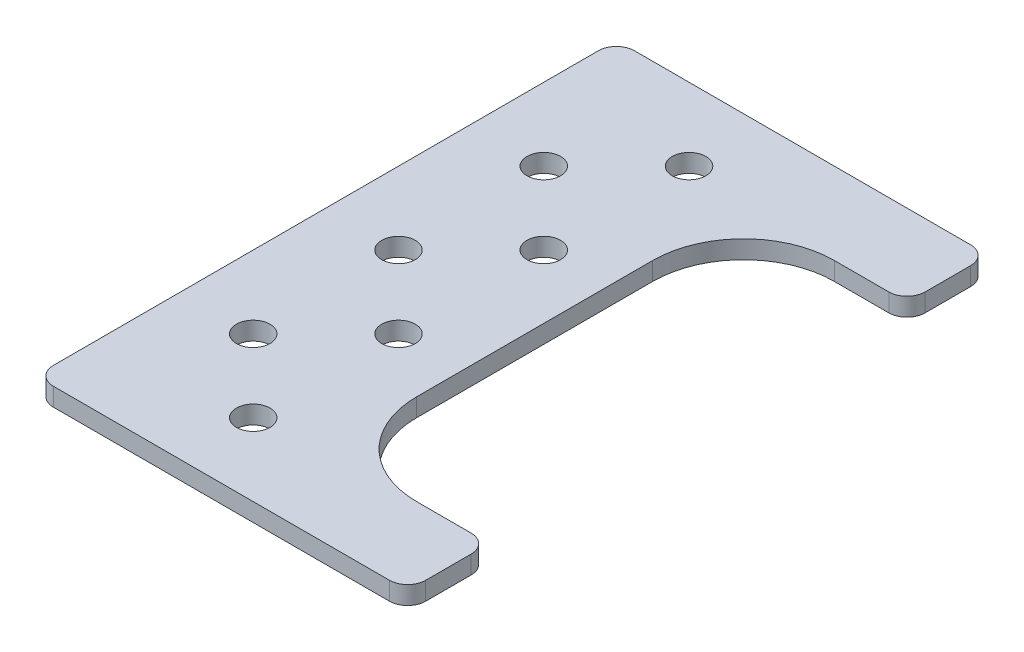
ISO-10303-21;
HEADER;
FILE_DESCRIPTION(('STEP AP214'),'2;1');
FILE_NAME('part.step','',(''),(''),'','','');
FILE_SCHEMA(('AUTOMOTIVE_DESIGN { 1 0 10303 214 1 1 1 1 }'));
ENDSEC;
DATA;
#1=APPLICATION_CONTEXT('core data for automotive mechanical design processes');
#2=APPLICATION_PROTOCOL_DEFINITION('international standard','automotive_design',2000,#1);
#3=PRODUCT_CONTEXT('',#1,'mechanical');
#4=PRODUCT('Part','Part','',(#3));
#5=PRODUCT_RELATED_PRODUCT_CATEGORY('part','',(#4));
#6=PRODUCT_DEFINITION_FORMATION('','',#4);
#7=PRODUCT_DEFINITION_CONTEXT('part definition',#1,'design');
#8=PRODUCT_DEFINITION('design','',#6,#7);
#9=PRODUCT_DEFINITION_SHAPE('','',#8);
#10=(LENGTH_UNIT() NAMED_UNIT(*) SI_UNIT(.MILLI.,.METRE.));
#11=(NAMED_UNIT(*) PLANE_ANGLE_UNIT() SI_UNIT($,.RADIAN.));
#12=(NAMED_UNIT(*) SI_UNIT($,.STERADIAN.) SOLID_ANGLE_UNIT());
#13=UNCERTAINTY_MEASURE_WITH_UNIT(LENGTH_MEASURE(1.E-05),#10,'distance_accuracy_value','');
#14=(GEOMETRIC_REPRESENTATION_CONTEXT(3) GLOBAL_UNCERTAINTY_ASSIGNED_CONTEXT((#13)) GLOBAL_UNIT_ASSIGNED_CONTEXT((#10,
#11,#12)) REPRESENTATION_CONTEXT('',''));
#15=CARTESIAN_POINT('',(0.,0.,0.));
#16=DIRECTION('',(0.,0.,1.));
#17=DIRECTION('',(1.,0.,0.));
#18=AXIS2_PLACEMENT_3D('',#15,#16,#17);
#19=CARTESIAN_POINT('',(0.,0.,0.));
#20=DIRECTION('',(0.,1.,0.));
#21=DIRECTION('',(0.,0.,1.));
#22=AXIS2_PLACEMENT_3D('',#19,#20,#21);
#23=PLANE('',#22);
#24=CARTESIAN_POINT('',(16.,0.,-8.));
#25=DIRECTION('',(0.,-1.,0.));
#26=DIRECTION('',(0.,0.,-1.));
#27=AXIS2_PLACEMENT_3D('',#24,#25,#26);
#28=CIRCLE('',#27,1.85);
#29=CARTESIAN_POINT('',(16.,0.,-9.85));
#30=VERTEX_POINT('',#29);
#31=EDGE_CURVE('E225',#30,#30,#28,.F.);
#32=ORIENTED_EDGE('',*,*,#31,.T.);
#33=EDGE_LOOP('',(#32));
#34=FACE_BOUND('',#33,.T.);
#35=CARTESIAN_POINT('',(16.,0.,-40.));
#36=DIRECTION('',(0.,-1.,0.));
#37=DIRECTION('',(0.,0.,-1.));
#38=AXIS2_PLACEMENT_3D('',#35,#36,#37);
#39=CIRCLE('',#38,1.85);
#40=CARTESIAN_POINT('',(16.,0.,-41.85));
#41=VERTEX_POINT('',#40);
#42=EDGE_CURVE('E228',#41,#41,#39,.F.);
#43=ORIENTED_EDGE('',*,*,#42,.T.);
#44=EDGE_LOOP('',(#43));
#45=FACE_BOUND('',#44,.T.);
#46=CARTESIAN_POINT('',(8.,0.,-16.));
#47=DIRECTION('',(0.,-1.,0.));
#48=DIRECTION('',(0.,0.,-1.));
#49=AXIS2_PLACEMENT_3D('',#46,#47,#48);
#50=CIRCLE('',#49,1.85);
#51=CARTESIAN_POINT('',(8.,0.,-17.85));
#52=VERTEX_POINT('',#51);
#53=EDGE_CURVE('E231',#52,#52,#50,.F.);
#54=ORIENTED_EDGE('',*,*,#53,.T.);
#55=EDGE_LOOP('',(#54));
#56=FACE_BOUND('',#55,.T.);
#57=CARTESIAN_POINT('',(8.,0.,-32.));
#58=DIRECTION('',(0.,-1.,0.));
#59=DIRECTION('',(0.,0.,-1.));
#60=AXIS2_PLACEMENT_3D('',#57,#58,#59);
#61=CIRCLE('',#60,1.85);
#62=CARTESIAN_POINT('',(8.,0.,-33.85));
#63=VERTEX_POINT('',#62);
#64=EDGE_CURVE('E234',#63,#63,#61,.F.);
#65=ORIENTED_EDGE('',*,*,#64,.T.);
#66=EDGE_LOOP('',(#65));
#67=FACE_BOUND('',#66,.T.);
#68=CARTESIAN_POINT('',(8.,0.,-48.));
#69=DIRECTION('',(0.,-1.,0.));
#70=DIRECTION('',(0.,0.,-1.));
#71=AXIS2_PLACEMENT_3D('',#68,#69,#70);
#72=CIRCLE('',#71,1.85);
#73=CARTESIAN_POINT('',(8.,0.,-49.85));
#74=VERTEX_POINT('',#73);
#75=EDGE_CURVE('E237',#74,#74,#72,.F.);
#76=ORIENTED_EDGE('',*,*,#75,.T.);
#77=EDGE_LOOP('',(#76));
#78=FACE_BOUND('',#77,.T.);
#79=CARTESIAN_POINT('',(16.,0.,-56.));
#80=DIRECTION('',(0.,-1.,0.));
#81=DIRECTION('',(0.,0.,-1.));
#82=AXIS2_PLACEMENT_3D('',#79,#80,#81);
#83=CIRCLE('',#82,1.85);
#84=CARTESIAN_POINT('',(16.,0.,-57.85));
#85=VERTEX_POINT('',#84);
#86=EDGE_CURVE('E240',#85,#85,#83,.F.);
#87=ORIENTED_EDGE('',*,*,#86,.T.);
#88=EDGE_LOOP('',(#87));
#89=FACE_BOUND('',#88,.T.);
#90=CARTESIAN_POINT('',(16.,0.,-24.));
#91=DIRECTION('',(0.,-1.,0.));
#92=DIRECTION('',(0.,0.,-1.));
#93=AXIS2_PLACEMENT_3D('',#90,#91,#92);
#94=CIRCLE('',#93,1.85);
#95=CARTESIAN_POINT('',(16.,0.,-25.85));
#96=VERTEX_POINT('',#95);
#97=EDGE_CURVE('E141',#96,#96,#94,.F.);
#98=ORIENTED_EDGE('',*,*,#97,.T.);
#99=EDGE_LOOP('',(#98));
#100=FACE_BOUND('',#99,.T.);
#101=DIRECTION('',(-1.,0.,0.));
#102=VECTOR('',#101,1.);
#103=CARTESIAN_POINT('',(0.,0.,0.));
#104=LINE('',#103,#102);
#105=CARTESIAN_POINT('',(39.,0.,0.));
#106=VERTEX_POINT('',#105);
#107=CARTESIAN_POINT('',(2.,0.,0.));
#108=VERTEX_POINT('',#107);
#109=EDGE_CURVE('E129',#106,#108,#104,.T.);
#110=ORIENTED_EDGE('',*,*,#109,.T.);
#111=CARTESIAN_POINT('',(2.,0.,-2.));
#112=DIRECTION('',(0.,-1.,0.));
#113=DIRECTION('',(0.,0.,-1.));
#114=AXIS2_PLACEMENT_3D('',#111,#112,#113);
#115=CIRCLE('',#114,2.);
#116=CARTESIAN_POINT('',(0.,0.,-2.));
#117=VERTEX_POINT('',#116);
#118=EDGE_CURVE('E144',#117,#108,#115,.F.);
#119=ORIENTED_EDGE('',*,*,#118,.F.);
#120=DIRECTION('',(0.,0.,-1.));
#121=VECTOR('',#120,1.);
#122=CARTESIAN_POINT('',(0.,0.,-64.));
#123=LINE('',#122,#121);
#124=CARTESIAN_POINT('',(0.,0.,-62.));
#125=VERTEX_POINT('',#124);
#126=EDGE_CURVE('E153',#117,#125,#123,.T.);
#127=ORIENTED_EDGE('',*,*,#126,.T.);
#128=CARTESIAN_POINT('',(1.99999999999999,0.,-62.));
#129=DIRECTION('',(0.,-1.,0.));
#130=DIRECTION('',(0.,0.,-1.));
#131=AXIS2_PLACEMENT_3D('',#128,#129,#130);
#132=CIRCLE('',#131,2.);
#133=CARTESIAN_POINT('',(1.99999999999999,0.,-64.));
#134=VERTEX_POINT('',#133);
#135=EDGE_CURVE('E156',#134,#125,#132,.F.);
#136=ORIENTED_EDGE('',*,*,#135,.F.);
#137=DIRECTION('',(1.,0.,0.));
#138=VECTOR('',#137,1.);
#139=CARTESIAN_POINT('',(41.,0.,-64.));
#140=LINE('',#139,#138);
#141=CARTESIAN_POINT('',(39.,0.,-64.));
#142=VERTEX_POINT('',#141);
#143=EDGE_CURVE('E157',#134,#142,#140,.T.);
#144=ORIENTED_EDGE('',*,*,#143,.T.);
#145=CARTESIAN_POINT('',(39.,0.,-62.));
#146=DIRECTION('',(0.,-1.,0.));
#147=DIRECTION('',(0.,0.,-1.));
#148=AXIS2_PLACEMENT_3D('',#145,#146,#147);
#149=CIRCLE('',#148,2.);
#150=CARTESIAN_POINT('',(41.,0.,-62.));
#151=VERTEX_POINT('',#150);
#152=EDGE_CURVE('E160',#151,#142,#149,.F.);
#153=ORIENTED_EDGE('',*,*,#152,.F.);
#154=DIRECTION('',(0.,0.,1.));
#155=VECTOR('',#154,1.);
#156=CARTESIAN_POINT('',(41.,0.,-64.));
#157=LINE('',#156,#155);
#158=CARTESIAN_POINT('',(41.,0.,-57.));
#159=VERTEX_POINT('',#158);
#160=EDGE_CURVE('E161',#151,#159,#157,.T.);
#161=ORIENTED_EDGE('',*,*,#160,.T.);
#162=CARTESIAN_POINT('',(39.,0.,-57.));
#163=DIRECTION('',(0.,-1.,0.));
#164=DIRECTION('',(0.,0.,-1.));
#165=AXIS2_PLACEMENT_3D('',#162,#163,#164);
#166=CIRCLE('',#165,2.);
#167=CARTESIAN_POINT('',(39.,0.,-55.));
#168=VERTEX_POINT('',#167);
#169=EDGE_CURVE('E164',#168,#159,#166,.F.);
#170=ORIENTED_EDGE('',*,*,#169,.F.);
#171=DIRECTION('',(-1.,0.,0.));
#172=VECTOR('',#171,1.);
#173=CARTESIAN_POINT('',(23.,0.,-55.));
#174=LINE('',#173,#172);
#175=CARTESIAN_POINT('',(33.,0.,-55.));
#176=VERTEX_POINT('',#175);
#177=EDGE_CURVE('E165',#168,#176,#174,.T.);
#178=ORIENTED_EDGE('',*,*,#177,.T.);
#179=CARTESIAN_POINT('',(33.,0.,-45.));
#180=DIRECTION('',(0.,1.,0.));
#181=DIRECTION('',(0.,0.,1.));
#182=AXIS2_PLACEMENT_3D('',#179,#180,#181);
#183=CIRCLE('',#182,10.);
#184=CARTESIAN_POINT('',(23.,0.,-45.));
#185=VERTEX_POINT('',#184);
#186=EDGE_CURVE('E254',#176,#185,#183,.T.);
#187=ORIENTED_EDGE('',*,*,#186,.T.);
#188=DIRECTION('',(0.,0.,1.));
#189=VECTOR('',#188,1.);
#190=CARTESIAN_POINT('',(23.,0.,-9.));
#191=LINE('',#190,#189);
#192=CARTESIAN_POINT('',(23.,0.,-19.));
#193=VERTEX_POINT('',#192);
#194=EDGE_CURVE('E169',#185,#193,#191,.T.);
#195=ORIENTED_EDGE('',*,*,#194,.T.);
#196=CARTESIAN_POINT('',(33.,0.,-19.));
#197=DIRECTION('',(0.,1.,0.));
#198=DIRECTION('',(0.,0.,1.));
#199=AXIS2_PLACEMENT_3D('',#196,#197,#198);
#200=CIRCLE('',#199,10.);
#201=CARTESIAN_POINT('',(33.,0.,-9.));
#202=VERTEX_POINT('',#201);
#203=EDGE_CURVE('E256',#193,#202,#200,.T.);
#204=ORIENTED_EDGE('',*,*,#203,.T.);
#205=DIRECTION('',(1.,0.,0.));
#206=VECTOR('',#205,1.);
#207=CARTESIAN_POINT('',(41.,0.,-9.));
#208=LINE('',#207,#206);
#209=CARTESIAN_POINT('',(39.,0.,-9.));
#210=VERTEX_POINT('',#209);
#211=EDGE_CURVE('E173',#202,#210,#208,.T.);
#212=ORIENTED_EDGE('',*,*,#211,.T.);
#213=CARTESIAN_POINT('',(39.,0.,-6.99999999999998));
#214=DIRECTION('',(0.,-1.,0.));
#215=DIRECTION('',(0.,0.,-1.));
#216=AXIS2_PLACEMENT_3D('',#213,#214,#215);
#217=CIRCLE('',#216,2.);
#218=CARTESIAN_POINT('',(41.,0.,-6.99999999999998));
#219=VERTEX_POINT('',#218);
#220=EDGE_CURVE('E176',#219,#210,#217,.F.);
#221=ORIENTED_EDGE('',*,*,#220,.F.);
#222=DIRECTION('',(0.,0.,1.));
#223=VECTOR('',#222,1.);
#224=CARTESIAN_POINT('',(41.,0.,-9.));
#225=LINE('',#224,#223);
#226=CARTESIAN_POINT('',(41.,0.,-2.00000000000001));
#227=VERTEX_POINT('',#226);
#228=EDGE_CURVE('E131',#219,#227,#225,.T.);
#229=ORIENTED_EDGE('',*,*,#228,.T.);
#230=CARTESIAN_POINT('',(39.,0.,-2.));
#231=DIRECTION('',(0.,-1.,0.));
#232=DIRECTION('',(0.,0.,-1.));
#233=AXIS2_PLACEMENT_3D('',#230,#231,#232);
#234=CIRCLE('',#233,2.);
#235=EDGE_CURVE('E18',#106,#227,#234,.F.);
#236=ORIENTED_EDGE('',*,*,#235,.F.);
#237=EDGE_LOOP('',(#110,#119,#127,#136,#144,#153,#161,#170,#178,#187,#195,#204,#212,#221,#229,#236));
#238=FACE_BOUND('',#237,.T.);
#239=ADVANCED_FACE('F15',(#34,#45,#56,#67,#78,#89,#100,#238),#23,.F.);
#240=CARTESIAN_POINT('',(39.,2.,-2.));
#241=DIRECTION('',(0.,-1.,0.));
#242=DIRECTION('',(0.,0.,-1.));
#243=AXIS2_PLACEMENT_3D('',#240,#241,#242);
#244=CYLINDRICAL_SURFACE('',#243,2.);
#245=DIRECTION('',(0.,1.,0.));
#246=VECTOR('',#245,1.);
#247=CARTESIAN_POINT('',(41.,2.,-2.00000000000002));
#248=LINE('',#247,#246);
#249=CARTESIAN_POINT('',(41.,2.,-2.00000000000001));
#250=VERTEX_POINT('',#249);
#251=EDGE_CURVE('E151',#227,#250,#248,.T.);
#252=ORIENTED_EDGE('',*,*,#251,.T.);
#253=CARTESIAN_POINT('',(39.,2.,-2.));
#254=DIRECTION('',(0.,-1.,0.));
#255=DIRECTION('',(0.,0.,-1.));
#256=AXIS2_PLACEMENT_3D('',#253,#254,#255);
#257=CIRCLE('',#256,2.);
#258=CARTESIAN_POINT('',(39.,2.,0.));
#259=VERTEX_POINT('',#258);
#260=EDGE_CURVE('E138',#259,#250,#257,.F.);
#261=ORIENTED_EDGE('',*,*,#260,.F.);
#262=DIRECTION('',(0.,1.,0.));
#263=VECTOR('',#262,1.);
#264=CARTESIAN_POINT('',(39.,2.,0.));
#265=LINE('',#264,#263);
#266=EDGE_CURVE('E135',#259,#106,#265,.F.);
#267=ORIENTED_EDGE('',*,*,#266,.T.);
#268=ORIENTED_EDGE('',*,*,#235,.T.);
#269=EDGE_LOOP('',(#252,#261,#267,#268));
#270=FACE_BOUND('',#269,.T.);
#271=ADVANCED_FACE('F136',(#270),#244,.T.);
#272=CARTESIAN_POINT('',(41.,2.,-9.));
#273=DIRECTION('',(-1.,0.,0.));
#274=DIRECTION('',(0.,0.,1.));
#275=AXIS2_PLACEMENT_3D('',#272,#273,#274);
#276=PLANE('',#275);
#277=ORIENTED_EDGE('',*,*,#228,.F.);
#278=DIRECTION('',(0.,-1.,0.));
#279=VECTOR('',#278,1.);
#280=CARTESIAN_POINT('',(41.,2.,-6.99999999999998));
#281=LINE('',#280,#279);
#282=CARTESIAN_POINT('',(41.,2.,-6.99999999999998));
#283=VERTEX_POINT('',#282);
#284=EDGE_CURVE('E258',#283,#219,#281,.T.);
#285=ORIENTED_EDGE('',*,*,#284,.F.);
#286=DIRECTION('',(0.,0.,1.));
#287=VECTOR('',#286,1.);
#288=CARTESIAN_POINT('',(41.,2.,0.));
#289=LINE('',#288,#287);
#290=EDGE_CURVE('E223',#250,#283,#289,.F.);
#291=ORIENTED_EDGE('',*,*,#290,.F.);
#292=ORIENTED_EDGE('',*,*,#251,.F.);
#293=EDGE_LOOP('',(#277,#285,#291,#292));
#294=FACE_BOUND('',#293,.T.);
#295=ADVANCED_FACE('F347',(#294),#276,.F.);
#296=CARTESIAN_POINT('',(39.,2.,-6.99999999999998));
#297=DIRECTION('',(0.,-1.,0.));
#298=DIRECTION('',(0.,0.,-1.));
#299=AXIS2_PLACEMENT_3D('',#296,#297,#298);
#300=CYLINDRICAL_SURFACE('',#299,2.);
#301=DIRECTION('',(0.,1.,0.));
#302=VECTOR('',#301,1.);
#303=CARTESIAN_POINT('',(39.,2.,-9.));
#304=LINE('',#303,#302);
#305=CARTESIAN_POINT('',(39.,2.,-9.));
#306=VERTEX_POINT('',#305);
#307=EDGE_CURVE('E175',#210,#306,#304,.T.);
#308=ORIENTED_EDGE('',*,*,#307,.T.);
#309=CARTESIAN_POINT('',(39.,2.,-6.99999999999998));
#310=DIRECTION('',(0.,-1.,0.));
#311=DIRECTION('',(0.,0.,-1.));
#312=AXIS2_PLACEMENT_3D('',#309,#310,#311);
#313=CIRCLE('',#312,2.);
#314=EDGE_CURVE('E220',#283,#306,#313,.F.);
#315=ORIENTED_EDGE('',*,*,#314,.F.);
#316=ORIENTED_EDGE('',*,*,#284,.T.);
#317=ORIENTED_EDGE('',*,*,#220,.T.);
#318=EDGE_LOOP('',(#308,#315,#316,#317));
#319=FACE_BOUND('',#318,.T.);
#320=ADVANCED_FACE('F344',(#319),#300,.T.);
#321=CARTESIAN_POINT('',(41.,2.,-9.));
#322=DIRECTION('',(0.,0.,1.));
#323=DIRECTION('',(1.,0.,0.));
#324=AXIS2_PLACEMENT_3D('',#321,#322,#323);
#325=PLANE('',#324);
#326=ORIENTED_EDGE('',*,*,#211,.F.);
#327=DIRECTION('',(0.,1.,0.));
#328=VECTOR('',#327,1.);
#329=CARTESIAN_POINT('',(33.,2.,-9.));
#330=LINE('',#329,#328);
#331=CARTESIAN_POINT('',(33.,2.,-9.));
#332=VERTEX_POINT('',#331);
#333=EDGE_CURVE('E172',#202,#332,#330,.T.);
#334=ORIENTED_EDGE('',*,*,#333,.T.);
#335=DIRECTION('',(1.,0.,0.));
#336=VECTOR('',#335,1.);
#337=CARTESIAN_POINT('',(0.,2.,-9.));
#338=LINE('',#337,#336);
#339=EDGE_CURVE('E219',#306,#332,#338,.F.);
#340=ORIENTED_EDGE('',*,*,#339,.F.);
#341=ORIENTED_EDGE('',*,*,#307,.F.);
#342=EDGE_LOOP('',(#326,#334,#340,#341));
#343=FACE_BOUND('',#342,.T.);
#344=ADVANCED_FACE('F343',(#343),#325,.F.);
#345=CARTESIAN_POINT('',(33.,2.,-19.));
#346=DIRECTION('',(0.,1.,0.));
#347=DIRECTION('',(0.,0.,1.));
#348=AXIS2_PLACEMENT_3D('',#345,#346,#347);
#349=CYLINDRICAL_SURFACE('',#348,10.);
#350=ORIENTED_EDGE('',*,*,#203,.F.);
#351=DIRECTION('',(0.,1.,0.));
#352=VECTOR('',#351,1.);
#353=CARTESIAN_POINT('',(23.,2.,-19.));
#354=LINE('',#353,#352);
#355=CARTESIAN_POINT('',(23.,2.,-19.));
#356=VERTEX_POINT('',#355);
#357=EDGE_CURVE('E171',#193,#356,#354,.T.);
#358=ORIENTED_EDGE('',*,*,#357,.T.);
#359=CARTESIAN_POINT('',(33.,2.,-19.));
#360=DIRECTION('',(0.,1.,0.));
#361=DIRECTION('',(0.,0.,1.));
#362=AXIS2_PLACEMENT_3D('',#359,#360,#361);
#363=CIRCLE('',#362,10.);
#364=EDGE_CURVE('E216',#332,#356,#363,.F.);
#365=ORIENTED_EDGE('',*,*,#364,.F.);
#366=ORIENTED_EDGE('',*,*,#333,.F.);
#367=EDGE_LOOP('',(#350,#358,#365,#366));
#368=FACE_BOUND('',#367,.T.);
#369=ADVANCED_FACE('F339',(#368),#349,.F.);
#370=CARTESIAN_POINT('',(23.,2.,-9.));
#371=DIRECTION('',(-1.,0.,0.));
#372=DIRECTION('',(0.,0.,1.));
#373=AXIS2_PLACEMENT_3D('',#370,#371,#372);
#374=PLANE('',#373);
#375=ORIENTED_EDGE('',*,*,#194,.F.);
#376=DIRECTION('',(0.,1.,0.));
#377=VECTOR('',#376,1.);
#378=CARTESIAN_POINT('',(23.,2.,-45.));
#379=LINE('',#378,#377);
#380=CARTESIAN_POINT('',(23.,2.,-45.));
#381=VERTEX_POINT('',#380);
#382=EDGE_CURVE('E168',#185,#381,#379,.T.);
#383=ORIENTED_EDGE('',*,*,#382,.T.);
#384=DIRECTION('',(0.,0.,1.));
#385=VECTOR('',#384,1.);
#386=CARTESIAN_POINT('',(23.,2.,0.));
#387=LINE('',#386,#385);
#388=EDGE_CURVE('E215',#356,#381,#387,.F.);
#389=ORIENTED_EDGE('',*,*,#388,.F.);
#390=ORIENTED_EDGE('',*,*,#357,.F.);
#391=EDGE_LOOP('',(#375,#383,#389,#390));
#392=FACE_BOUND('',#391,.T.);
#393=ADVANCED_FACE('F333',(#392),#374,.F.);
#394=CARTESIAN_POINT('',(33.,2.,-45.));
#395=DIRECTION('',(0.,1.,0.));
#396=DIRECTION('',(0.,0.,1.));
#397=AXIS2_PLACEMENT_3D('',#394,#395,#396);
#398=CYLINDRICAL_SURFACE('',#397,10.);
#399=ORIENTED_EDGE('',*,*,#186,.F.);
#400=DIRECTION('',(0.,1.,0.));
#401=VECTOR('',#400,1.);
#402=CARTESIAN_POINT('',(33.,2.,-55.));
#403=LINE('',#402,#401);
#404=CARTESIAN_POINT('',(33.,2.,-55.));
#405=VERTEX_POINT('',#404);
#406=EDGE_CURVE('E167',#176,#405,#403,.T.);
#407=ORIENTED_EDGE('',*,*,#406,.T.);
#408=CARTESIAN_POINT('',(33.,2.,-45.));
#409=DIRECTION('',(0.,1.,0.));
#410=DIRECTION('',(0.,0.,1.));
#411=AXIS2_PLACEMENT_3D('',#408,#409,#410);
#412=CIRCLE('',#411,10.);
#413=EDGE_CURVE('E212',#381,#405,#412,.F.);
#414=ORIENTED_EDGE('',*,*,#413,.F.);
#415=ORIENTED_EDGE('',*,*,#382,.F.);
#416=EDGE_LOOP('',(#399,#407,#414,#415));
#417=FACE_BOUND('',#416,.T.);
#418=ADVANCED_FACE('F329',(#417),#398,.F.);
#419=CARTESIAN_POINT('',(23.,2.,-55.));
#420=DIRECTION('',(0.,0.,-1.));
#421=DIRECTION('',(-1.,0.,0.));
#422=AXIS2_PLACEMENT_3D('',#419,#420,#421);
#423=PLANE('',#422);
#424=DIRECTION('',(1.,0.,0.));
#425=VECTOR('',#424,1.);
#426=CARTESIAN_POINT('',(0.,2.,-55.));
#427=LINE('',#426,#425);
#428=CARTESIAN_POINT('',(39.,2.,-55.));
#429=VERTEX_POINT('',#428);
#430=EDGE_CURVE('E211',#405,#429,#427,.T.);
#431=ORIENTED_EDGE('',*,*,#430,.F.);
#432=ORIENTED_EDGE('',*,*,#406,.F.);
#433=ORIENTED_EDGE('',*,*,#177,.F.);
#434=DIRECTION('',(0.,-1.,0.));
#435=VECTOR('',#434,1.);
#436=CARTESIAN_POINT('',(39.,2.,-55.));
#437=LINE('',#436,#435);
#438=EDGE_CURVE('E253',#429,#168,#437,.T.);
#439=ORIENTED_EDGE('',*,*,#438,.F.);
#440=EDGE_LOOP('',(#431,#432,#433,#439));
#441=FACE_BOUND('',#440,.T.);
#442=ADVANCED_FACE('F323',(#441),#423,.F.);
#443=CARTESIAN_POINT('',(39.,2.,-57.));
#444=DIRECTION('',(0.,-1.,0.));
#445=DIRECTION('',(0.,0.,-1.));
#446=AXIS2_PLACEMENT_3D('',#443,#444,#445);
#447=CYLINDRICAL_SURFACE('',#446,2.);
#448=DIRECTION('',(0.,1.,0.));
#449=VECTOR('',#448,1.);
#450=CARTESIAN_POINT('',(41.,2.,-57.));
#451=LINE('',#450,#449);
#452=CARTESIAN_POINT('',(41.,2.,-57.));
#453=VERTEX_POINT('',#452);
#454=EDGE_CURVE('E163',#159,#453,#451,.T.);
#455=ORIENTED_EDGE('',*,*,#454,.T.);
#456=CARTESIAN_POINT('',(39.,2.,-57.));
#457=DIRECTION('',(0.,-1.,0.));
#458=DIRECTION('',(0.,0.,-1.));
#459=AXIS2_PLACEMENT_3D('',#456,#457,#458);
#460=CIRCLE('',#459,2.);
#461=EDGE_CURVE('E208',#429,#453,#460,.F.);
#462=ORIENTED_EDGE('',*,*,#461,.F.);
#463=ORIENTED_EDGE('',*,*,#438,.T.);
#464=ORIENTED_EDGE('',*,*,#169,.T.);
#465=EDGE_LOOP('',(#455,#462,#463,#464));
#466=FACE_BOUND('',#465,.T.);
#467=ADVANCED_FACE('F319',(#466),#447,.T.);
#468=CARTESIAN_POINT('',(41.,2.,-64.));
#469=DIRECTION('',(-1.,0.,0.));
#470=DIRECTION('',(0.,0.,1.));
#471=AXIS2_PLACEMENT_3D('',#468,#469,#470);
#472=PLANE('',#471);
#473=DIRECTION('',(0.,0.,1.));
#474=VECTOR('',#473,1.);
#475=CARTESIAN_POINT('',(41.,2.,0.));
#476=LINE('',#475,#474);
#477=CARTESIAN_POINT('',(41.,2.,-62.));
#478=VERTEX_POINT('',#477);
#479=EDGE_CURVE('E207',#453,#478,#476,.F.);
#480=ORIENTED_EDGE('',*,*,#479,.F.);
#481=ORIENTED_EDGE('',*,*,#454,.F.);
#482=ORIENTED_EDGE('',*,*,#160,.F.);
#483=DIRECTION('',(0.,-1.,0.));
#484=VECTOR('',#483,1.);
#485=CARTESIAN_POINT('',(41.,2.,-62.));
#486=LINE('',#485,#484);
#487=EDGE_CURVE('E250',#478,#151,#486,.T.);
#488=ORIENTED_EDGE('',*,*,#487,.F.);
#489=EDGE_LOOP('',(#480,#481,#482,#488));
#490=FACE_BOUND('',#489,.T.);
#491=ADVANCED_FACE('F315',(#490),#472,.F.);
#492=CARTESIAN_POINT('',(39.,2.,-62.));
#493=DIRECTION('',(0.,-1.,0.));
#494=DIRECTION('',(0.,0.,-1.));
#495=AXIS2_PLACEMENT_3D('',#492,#493,#494);
#496=CYLINDRICAL_SURFACE('',#495,2.);
#497=DIRECTION('',(0.,1.,0.));
#498=VECTOR('',#497,1.);
#499=CARTESIAN_POINT('',(39.,2.,-64.));
#500=LINE('',#499,#498);
#501=CARTESIAN_POINT('',(39.,2.,-64.));
#502=VERTEX_POINT('',#501);
#503=EDGE_CURVE('E159',#142,#502,#500,.T.);
#504=ORIENTED_EDGE('',*,*,#503,.T.);
#505=CARTESIAN_POINT('',(39.,2.,-62.));
#506=DIRECTION('',(0.,-1.,0.));
#507=DIRECTION('',(0.,0.,-1.));
#508=AXIS2_PLACEMENT_3D('',#505,#506,#507);
#509=CIRCLE('',#508,2.);
#510=EDGE_CURVE('E204',#478,#502,#509,.F.);
#511=ORIENTED_EDGE('',*,*,#510,.F.);
#512=ORIENTED_EDGE('',*,*,#487,.T.);
#513=ORIENTED_EDGE('',*,*,#152,.T.);
#514=EDGE_LOOP('',(#504,#511,#512,#513));
#515=FACE_BOUND('',#514,.T.);
#516=ADVANCED_FACE('F311',(#515),#496,.T.);
#517=CARTESIAN_POINT('',(41.,2.,-64.));
#518=DIRECTION('',(0.,0.,1.));
#519=DIRECTION('',(1.,0.,0.));
#520=AXIS2_PLACEMENT_3D('',#517,#518,#519);
#521=PLANE('',#520);
#522=ORIENTED_EDGE('',*,*,#143,.F.);
#523=DIRECTION('',(0.,-1.,0.));
#524=VECTOR('',#523,1.);
#525=CARTESIAN_POINT('',(1.99999999999999,2.,-64.));
#526=LINE('',#525,#524);
#527=CARTESIAN_POINT('',(1.99999999999999,2.,-64.));
#528=VERTEX_POINT('',#527);
#529=EDGE_CURVE('E247',#528,#134,#526,.T.);
#530=ORIENTED_EDGE('',*,*,#529,.F.);
#531=DIRECTION('',(1.,0.,0.));
#532=VECTOR('',#531,1.);
#533=CARTESIAN_POINT('',(0.,2.,-64.));
#534=LINE('',#533,#532);
#535=EDGE_CURVE('E203',#502,#528,#534,.F.);
#536=ORIENTED_EDGE('',*,*,#535,.F.);
#537=ORIENTED_EDGE('',*,*,#503,.F.);
#538=EDGE_LOOP('',(#522,#530,#536,#537));
#539=FACE_BOUND('',#538,.T.);
#540=ADVANCED_FACE('F307',(#539),#521,.F.);
#541=CARTESIAN_POINT('',(1.99999999999999,2.,-62.));
#542=DIRECTION('',(0.,-1.,0.));
#543=DIRECTION('',(0.,0.,-1.));
#544=AXIS2_PLACEMENT_3D('',#541,#542,#543);
#545=CYLINDRICAL_SURFACE('',#544,2.);
#546=DIRECTION('',(0.,1.,0.));
#547=VECTOR('',#546,1.);
#548=CARTESIAN_POINT('',(0.,2.,-62.));
#549=LINE('',#548,#547);
#550=CARTESIAN_POINT('',(0.,2.,-62.));
#551=VERTEX_POINT('',#550);
#552=EDGE_CURVE('E155',#125,#551,#549,.T.);
#553=ORIENTED_EDGE('',*,*,#552,.T.);
#554=CARTESIAN_POINT('',(1.99999999999999,2.,-62.));
#555=DIRECTION('',(0.,-1.,0.));
#556=DIRECTION('',(0.,0.,-1.));
#557=AXIS2_PLACEMENT_3D('',#554,#555,#556);
#558=CIRCLE('',#557,2.);
#559=EDGE_CURVE('E200',#528,#551,#558,.F.);
#560=ORIENTED_EDGE('',*,*,#559,.F.);
#561=ORIENTED_EDGE('',*,*,#529,.T.);
#562=ORIENTED_EDGE('',*,*,#135,.T.);
#563=EDGE_LOOP('',(#553,#560,#561,#562));
#564=FACE_BOUND('',#563,.T.);
#565=ADVANCED_FACE('F303',(#564),#545,.T.);
#566=CARTESIAN_POINT('',(0.,2.,-64.));
#567=DIRECTION('',(1.,0.,0.));
#568=DIRECTION('',(0.,0.,-1.));
#569=AXIS2_PLACEMENT_3D('',#566,#567,#568);
#570=PLANE('',#569);
#571=DIRECTION('',(0.,0.,1.));
#572=VECTOR('',#571,1.);
#573=CARTESIAN_POINT('',(0.,2.,0.));
#574=LINE('',#573,#572);
#575=CARTESIAN_POINT('',(0.,2.,-2.));
#576=VERTEX_POINT('',#575);
#577=EDGE_CURVE('E199',#551,#576,#574,.T.);
#578=ORIENTED_EDGE('',*,*,#577,.F.);
#579=ORIENTED_EDGE('',*,*,#552,.F.);
#580=ORIENTED_EDGE('',*,*,#126,.F.);
#581=DIRECTION('',(0.,-1.,0.));
#582=VECTOR('',#581,1.);
#583=CARTESIAN_POINT('',(0.,2.,-2.));
#584=LINE('',#583,#582);
#585=EDGE_CURVE('E147',#576,#117,#584,.T.);
#586=ORIENTED_EDGE('',*,*,#585,.F.);
#587=EDGE_LOOP('',(#578,#579,#580,#586));
#588=FACE_BOUND('',#587,.T.);
#589=ADVANCED_FACE('F299',(#588),#570,.F.);
#590=CARTESIAN_POINT('',(2.,2.,-2.));
#591=DIRECTION('',(0.,-1.,0.));
#592=DIRECTION('',(0.,0.,-1.));
#593=AXIS2_PLACEMENT_3D('',#590,#591,#592);
#594=CYLINDRICAL_SURFACE('',#593,2.);
#595=DIRECTION('',(0.,1.,0.));
#596=VECTOR('',#595,1.);
#597=CARTESIAN_POINT('',(2.,2.,0.));
#598=LINE('',#597,#596);
#599=CARTESIAN_POINT('',(2.,2.,0.));
#600=VERTEX_POINT('',#599);
#601=EDGE_CURVE('E33',#108,#600,#598,.T.);
#602=ORIENTED_EDGE('',*,*,#601,.T.);
#603=CARTESIAN_POINT('',(2.,2.,-2.));
#604=DIRECTION('',(0.,-1.,0.));
#605=DIRECTION('',(0.,0.,-1.));
#606=AXIS2_PLACEMENT_3D('',#603,#604,#605);
#607=CIRCLE('',#606,2.);
#608=EDGE_CURVE('E196',#576,#600,#607,.F.);
#609=ORIENTED_EDGE('',*,*,#608,.F.);
#610=ORIENTED_EDGE('',*,*,#585,.T.);
#611=ORIENTED_EDGE('',*,*,#118,.T.);
#612=EDGE_LOOP('',(#602,#609,#610,#611));
#613=FACE_BOUND('',#612,.T.);
#614=ADVANCED_FACE('F297',(#613),#594,.T.);
#615=CARTESIAN_POINT('',(0.,2.,0.));
#616=DIRECTION('',(0.,0.,-1.));
#617=DIRECTION('',(-1.,0.,0.));
#618=AXIS2_PLACEMENT_3D('',#615,#616,#617);
#619=PLANE('',#618);
#620=DIRECTION('',(1.,0.,0.));
#621=VECTOR('',#620,1.);
#622=CARTESIAN_POINT('',(0.,2.,0.));
#623=LINE('',#622,#621);
#624=EDGE_CURVE('E195',#600,#259,#623,.T.);
#625=ORIENTED_EDGE('',*,*,#624,.F.);
#626=ORIENTED_EDGE('',*,*,#601,.F.);
#627=ORIENTED_EDGE('',*,*,#109,.F.);
#628=ORIENTED_EDGE('',*,*,#266,.F.);
#629=EDGE_LOOP('',(#625,#626,#627,#628));
#630=FACE_BOUND('',#629,.T.);
#631=ADVANCED_FACE('F143',(#630),#619,.F.);
#632=CARTESIAN_POINT('',(16.,2.,-24.));
#633=DIRECTION('',(0.,-1.,0.));
#634=DIRECTION('',(0.,0.,-1.));
#635=AXIS2_PLACEMENT_3D('',#632,#633,#634);
#636=CYLINDRICAL_SURFACE('',#635,1.85);
#637=ORIENTED_EDGE('',*,*,#97,.F.);
#638=EDGE_LOOP('',(#637));
#639=FACE_BOUND('',#638,.T.);
#640=CARTESIAN_POINT('',(16.,2.,-24.));
#641=DIRECTION('',(0.,-1.,0.));
#642=DIRECTION('',(0.,0.,-1.));
#643=AXIS2_PLACEMENT_3D('',#640,#641,#642);
#644=CIRCLE('',#643,1.85);
#645=CARTESIAN_POINT('',(16.,2.,-25.85));
#646=VERTEX_POINT('',#645);
#647=EDGE_CURVE('E192',#646,#646,#644,.T.);
#648=ORIENTED_EDGE('',*,*,#647,.F.);
#649=EDGE_LOOP('',(#648));
#650=FACE_BOUND('',#649,.T.);
#651=ADVANCED_FACE('F386',(#639,#650),#636,.F.);
#652=CARTESIAN_POINT('',(16.,2.,-56.));
#653=DIRECTION('',(0.,-1.,0.));
#654=DIRECTION('',(0.,0.,-1.));
#655=AXIS2_PLACEMENT_3D('',#652,#653,#654);
#656=CYLINDRICAL_SURFACE('',#655,1.85);
#657=ORIENTED_EDGE('',*,*,#86,.F.);
#658=EDGE_LOOP('',(#657));
#659=FACE_BOUND('',#658,.T.);
#660=CARTESIAN_POINT('',(16.,2.,-56.));
#661=DIRECTION('',(0.,-1.,0.));
#662=DIRECTION('',(0.,0.,-1.));
#663=AXIS2_PLACEMENT_3D('',#660,#661,#662);
#664=CIRCLE('',#663,1.85);
#665=CARTESIAN_POINT('',(16.,2.,-57.85));
#666=VERTEX_POINT('',#665);
#667=EDGE_CURVE('E189',#666,#666,#664,.T.);
#668=ORIENTED_EDGE('',*,*,#667,.F.);
#669=EDGE_LOOP('',(#668));
#670=FACE_BOUND('',#669,.T.);
#671=ADVANCED_FACE('F382',(#659,#670),#656,.F.);
#672=CARTESIAN_POINT('',(8.,2.,-48.));
#673=DIRECTION('',(0.,-1.,0.));
#674=DIRECTION('',(0.,0.,-1.));
#675=AXIS2_PLACEMENT_3D('',#672,#673,#674);
#676=CYLINDRICAL_SURFACE('',#675,1.85);
#677=ORIENTED_EDGE('',*,*,#75,.F.);
#678=EDGE_LOOP('',(#677));
#679=FACE_BOUND('',#678,.T.);
#680=CARTESIAN_POINT('',(8.,2.,-48.));
#681=DIRECTION('',(0.,-1.,0.));
#682=DIRECTION('',(0.,0.,-1.));
#683=AXIS2_PLACEMENT_3D('',#680,#681,#682);
#684=CIRCLE('',#683,1.85);
#685=CARTESIAN_POINT('',(8.,2.,-49.85));
#686=VERTEX_POINT('',#685);
#687=EDGE_CURVE('E186',#686,#686,#684,.T.);
#688=ORIENTED_EDGE('',*,*,#687,.F.);
#689=EDGE_LOOP('',(#688));
#690=FACE_BOUND('',#689,.T.);
#691=ADVANCED_FACE('F378',(#679,#690),#676,.F.);
#692=CARTESIAN_POINT('',(8.,2.,-32.));
#693=DIRECTION('',(0.,-1.,0.));
#694=DIRECTION('',(0.,0.,-1.));
#695=AXIS2_PLACEMENT_3D('',#692,#693,#694);
#696=CYLINDRICAL_SURFACE('',#695,1.85);
#697=ORIENTED_EDGE('',*,*,#64,.F.);
#698=EDGE_LOOP('',(#697));
#699=FACE_BOUND('',#698,.T.);
#700=CARTESIAN_POINT('',(8.,2.,-32.));
#701=DIRECTION('',(0.,-1.,0.));
#702=DIRECTION('',(0.,0.,-1.));
#703=AXIS2_PLACEMENT_3D('',#700,#701,#702);
#704=CIRCLE('',#703,1.85);
#705=CARTESIAN_POINT('',(8.,2.,-33.85));
#706=VERTEX_POINT('',#705);
#707=EDGE_CURVE('E183',#706,#706,#704,.T.);
#708=ORIENTED_EDGE('',*,*,#707,.F.);
#709=EDGE_LOOP('',(#708));
#710=FACE_BOUND('',#709,.T.);
#711=ADVANCED_FACE('F374',(#699,#710),#696,.F.);
#712=CARTESIAN_POINT('',(8.,2.,-16.));
#713=DIRECTION('',(0.,-1.,0.));
#714=DIRECTION('',(0.,0.,-1.));
#715=AXIS2_PLACEMENT_3D('',#712,#713,#714);
#716=CYLINDRICAL_SURFACE('',#715,1.85);
#717=ORIENTED_EDGE('',*,*,#53,.F.);
#718=EDGE_LOOP('',(#717));
#719=FACE_BOUND('',#718,.T.);
#720=CARTESIAN_POINT('',(8.,2.,-16.));
#721=DIRECTION('',(0.,-1.,0.));
#722=DIRECTION('',(0.,0.,-1.));
#723=AXIS2_PLACEMENT_3D('',#720,#721,#722);
#724=CIRCLE('',#723,1.85);
#725=CARTESIAN_POINT('',(8.,2.,-17.85));
#726=VERTEX_POINT('',#725);
#727=EDGE_CURVE('E180',#726,#726,#724,.T.);
#728=ORIENTED_EDGE('',*,*,#727,.F.);
#729=EDGE_LOOP('',(#728));
#730=FACE_BOUND('',#729,.T.);
#731=ADVANCED_FACE('F370',(#719,#730),#716,.F.);
#732=CARTESIAN_POINT('',(16.,2.,-40.));
#733=DIRECTION('',(0.,-1.,0.));
#734=DIRECTION('',(0.,0.,-1.));
#735=AXIS2_PLACEMENT_3D('',#732,#733,#734);
#736=CYLINDRICAL_SURFACE('',#735,1.85);
#737=ORIENTED_EDGE('',*,*,#42,.F.);
#738=EDGE_LOOP('',(#737));
#739=FACE_BOUND('',#738,.T.);
#740=CARTESIAN_POINT('',(16.,2.,-40.));
#741=DIRECTION('',(0.,-1.,0.));
#742=DIRECTION('',(0.,0.,-1.));
#743=AXIS2_PLACEMENT_3D('',#740,#741,#742);
#744=CIRCLE('',#743,1.85);
#745=CARTESIAN_POINT('',(16.,2.,-41.85));
#746=VERTEX_POINT('',#745);
#747=EDGE_CURVE('E24',#746,#746,#744,.T.);
#748=ORIENTED_EDGE('',*,*,#747,.F.);
#749=EDGE_LOOP('',(#748));
#750=FACE_BOUND('',#749,.T.);
#751=ADVANCED_FACE('F363',(#739,#750),#736,.F.);
#752=CARTESIAN_POINT('',(16.,2.,-8.));
#753=DIRECTION('',(0.,-1.,0.));
#754=DIRECTION('',(0.,0.,-1.));
#755=AXIS2_PLACEMENT_3D('',#752,#753,#754);
#756=CYLINDRICAL_SURFACE('',#755,1.85);
#757=ORIENTED_EDGE('',*,*,#31,.F.);
#758=EDGE_LOOP('',(#757));
#759=FACE_BOUND('',#758,.T.);
#760=CARTESIAN_POINT('',(16.,2.,-8.));
#761=DIRECTION('',(0.,-1.,0.));
#762=DIRECTION('',(0.,0.,-1.));
#763=AXIS2_PLACEMENT_3D('',#760,#761,#762);
#764=CIRCLE('',#763,1.85);
#765=CARTESIAN_POINT('',(16.,2.,-9.85));
#766=VERTEX_POINT('',#765);
#767=EDGE_CURVE('E10',#766,#766,#764,.T.);
#768=ORIENTED_EDGE('',*,*,#767,.F.);
#769=EDGE_LOOP('',(#768));
#770=FACE_BOUND('',#769,.T.);
#771=ADVANCED_FACE('F357',(#759,#770),#756,.F.);
#772=CARTESIAN_POINT('',(0.,2.,0.));
#773=DIRECTION('',(0.,1.,0.));
#774=DIRECTION('',(0.,0.,1.));
#775=AXIS2_PLACEMENT_3D('',#772,#773,#774);
#776=PLANE('',#775);
#777=ORIENTED_EDGE('',*,*,#767,.T.);
#778=EDGE_LOOP('',(#777));
#779=FACE_BOUND('',#778,.T.);
#780=ORIENTED_EDGE('',*,*,#747,.T.);
#781=EDGE_LOOP('',(#780));
#782=FACE_BOUND('',#781,.T.);
#783=ORIENTED_EDGE('',*,*,#727,.T.);
#784=EDGE_LOOP('',(#783));
#785=FACE_BOUND('',#784,.T.);
#786=ORIENTED_EDGE('',*,*,#707,.T.);
#787=EDGE_LOOP('',(#786));
#788=FACE_BOUND('',#787,.T.);
#789=ORIENTED_EDGE('',*,*,#687,.T.);
#790=EDGE_LOOP('',(#789));
#791=FACE_BOUND('',#790,.T.);
#792=ORIENTED_EDGE('',*,*,#667,.T.);
#793=EDGE_LOOP('',(#792));
#794=FACE_BOUND('',#793,.T.);
#795=ORIENTED_EDGE('',*,*,#647,.T.);
#796=EDGE_LOOP('',(#795));
#797=FACE_BOUND('',#796,.T.);
#798=ORIENTED_EDGE('',*,*,#608,.T.);
#799=ORIENTED_EDGE('',*,*,#624,.T.);
#800=ORIENTED_EDGE('',*,*,#260,.T.);
#801=ORIENTED_EDGE('',*,*,#290,.T.);
#802=ORIENTED_EDGE('',*,*,#314,.T.);
#803=ORIENTED_EDGE('',*,*,#339,.T.);
#804=ORIENTED_EDGE('',*,*,#364,.T.);
#805=ORIENTED_EDGE('',*,*,#388,.T.);
#806=ORIENTED_EDGE('',*,*,#413,.T.);
#807=ORIENTED_EDGE('',*,*,#430,.T.);
#808=ORIENTED_EDGE('',*,*,#461,.T.);
#809=ORIENTED_EDGE('',*,*,#479,.T.);
#810=ORIENTED_EDGE('',*,*,#510,.T.);
#811=ORIENTED_EDGE('',*,*,#535,.T.);
#812=ORIENTED_EDGE('',*,*,#559,.T.);
#813=ORIENTED_EDGE('',*,*,#577,.T.);
#814=EDGE_LOOP('',(#798,#799,#800,#801,#802,#803,#804,#805,#806,#807,#808,#809,#810,#811,#812,#813));
#815=FACE_BOUND('',#814,.T.);
#816=ADVANCED_FACE('F295',(#779,#782,#785,#788,#791,#794,#797,#815),#776,.T.);
#817=CLOSED_SHELL('',(#239,#271,#295,#320,#344,#369,#393,#418,#442,#467,#491,#516,#540,#565,
#589,#614,#631,#651,#671,#691,#711,#731,#751,#771,#816));
#818=MANIFOLD_SOLID_BREP('B1',#817);
#819=ADVANCED_BREP_SHAPE_REPRESENTATION('',(#18,#818),#14);
#820=SHAPE_DEFINITION_REPRESENTATION(#9,#819);
ENDSEC;
END-ISO-10303-21;
